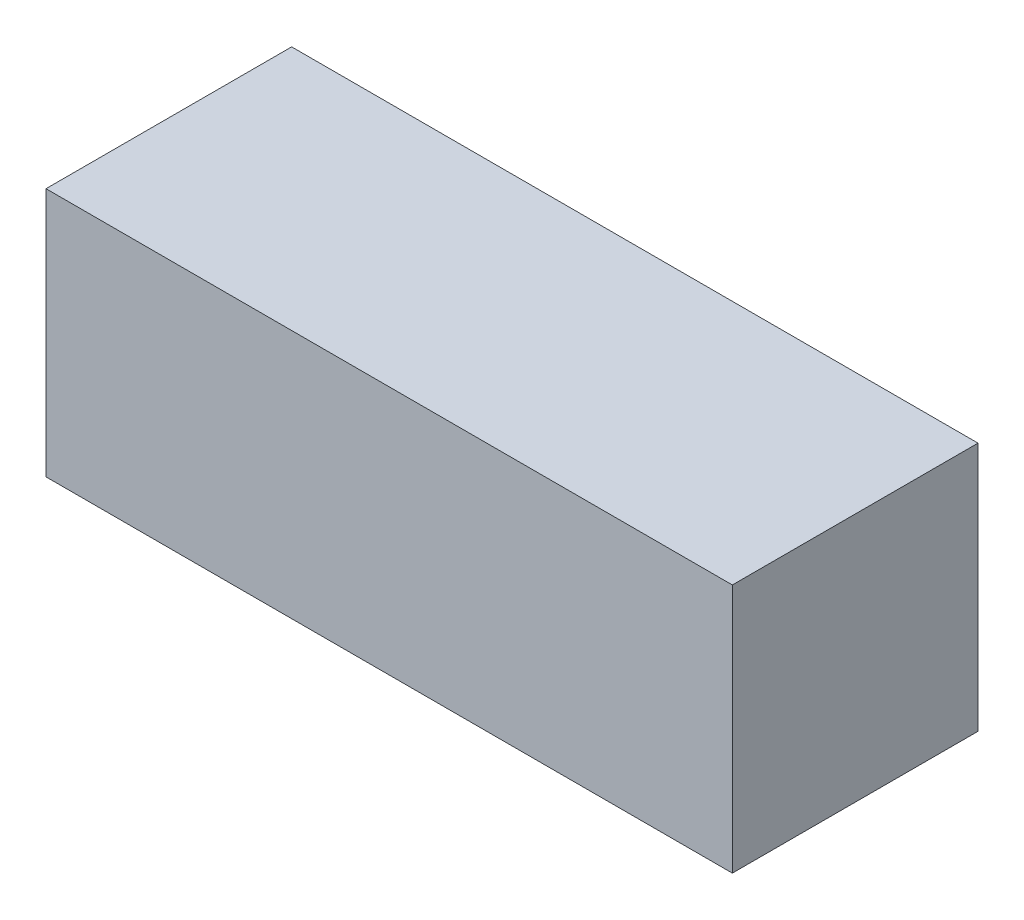
ISO-10303-21;
HEADER;
FILE_DESCRIPTION(('STEP AP214'),'2;1');
FILE_NAME('part.step','',(''),(''),'','','');
FILE_SCHEMA(('AUTOMOTIVE_DESIGN { 1 0 10303 214 1 1 1 1 }'));
ENDSEC;
DATA;
#1=APPLICATION_CONTEXT('core data for automotive mechanical design processes');
#2=APPLICATION_PROTOCOL_DEFINITION('international standard','automotive_design',2000,#1);
#3=PRODUCT_CONTEXT('',#1,'mechanical');
#4=PRODUCT('Part','Part','',(#3));
#5=PRODUCT_RELATED_PRODUCT_CATEGORY('part','',(#4));
#6=PRODUCT_DEFINITION_FORMATION('','',#4);
#7=PRODUCT_DEFINITION_CONTEXT('part definition',#1,'design');
#8=PRODUCT_DEFINITION('design','',#6,#7);
#9=PRODUCT_DEFINITION_SHAPE('','',#8);
#10=(LENGTH_UNIT() NAMED_UNIT(*) SI_UNIT(.MILLI.,.METRE.));
#11=(NAMED_UNIT(*) PLANE_ANGLE_UNIT() SI_UNIT($,.RADIAN.));
#12=(NAMED_UNIT(*) SI_UNIT($,.STERADIAN.) SOLID_ANGLE_UNIT());
#13=UNCERTAINTY_MEASURE_WITH_UNIT(LENGTH_MEASURE(1.E-05),#10,'distance_accuracy_value','');
#14=(GEOMETRIC_REPRESENTATION_CONTEXT(3) GLOBAL_UNCERTAINTY_ASSIGNED_CONTEXT((#13)) GLOBAL_UNIT_ASSIGNED_CONTEXT((#10,
#11,#12)) REPRESENTATION_CONTEXT('',''));
#15=CARTESIAN_POINT('',(0.,0.,0.));
#16=DIRECTION('',(0.,0.,1.));
#17=DIRECTION('',(1.,0.,0.));
#18=AXIS2_PLACEMENT_3D('',#15,#16,#17);
#19=CARTESIAN_POINT('',(0.,0.,0.1999996));
#20=DIRECTION('',(0.,0.,1.));
#21=DIRECTION('',(1.,0.,0.));
#22=AXIS2_PLACEMENT_3D('',#19,#20,#21);
#23=PLANE('',#22);
#24=DIRECTION('',(-1.,0.,0.));
#25=VECTOR('',#24,1.);
#26=CARTESIAN_POINT('',(0.2794,0.1016,0.1999996));
#27=LINE('',#26,#25);
#28=CARTESIAN_POINT('',(0.2794,0.1016,0.1999996));
#29=VERTEX_POINT('',#28);
#30=CARTESIAN_POINT('',(-0.2794,0.1016,0.1999996));
#31=VERTEX_POINT('',#30);
#32=EDGE_CURVE('E89',#29,#31,#27,.T.);
#33=ORIENTED_EDGE('',*,*,#32,.T.);
#34=DIRECTION('',(0.,-1.,0.));
#35=VECTOR('',#34,1.);
#36=CARTESIAN_POINT('',(-0.2794,0.1016,0.1999996));
#37=LINE('',#36,#35);
#38=CARTESIAN_POINT('',(-0.2794,-0.1016,0.1999996));
#39=VERTEX_POINT('',#38);
#40=EDGE_CURVE('E108',#31,#39,#37,.T.);
#41=ORIENTED_EDGE('',*,*,#40,.T.);
#42=DIRECTION('',(1.,0.,0.));
#43=VECTOR('',#42,1.);
#44=CARTESIAN_POINT('',(-0.2794,-0.1016,0.1999996));
#45=LINE('',#44,#43);
#46=CARTESIAN_POINT('',(0.2794,-0.1016,0.1999996));
#47=VERTEX_POINT('',#46);
#48=EDGE_CURVE('E51',#39,#47,#45,.T.);
#49=ORIENTED_EDGE('',*,*,#48,.T.);
#50=DIRECTION('',(0.,1.,0.));
#51=VECTOR('',#50,1.);
#52=CARTESIAN_POINT('',(0.2794,-0.1016,0.1999996));
#53=LINE('',#52,#51);
#54=EDGE_CURVE('E11',#47,#29,#53,.T.);
#55=ORIENTED_EDGE('',*,*,#54,.T.);
#56=EDGE_LOOP('',(#33,#41,#49,#55));
#57=FACE_BOUND('',#56,.T.);
#58=ADVANCED_FACE('F17',(#57),#23,.T.);
#59=CARTESIAN_POINT('',(0.,0.,0.));
#60=DIRECTION('',(0.,0.,1.));
#61=DIRECTION('',(1.,0.,0.));
#62=AXIS2_PLACEMENT_3D('',#59,#60,#61);
#63=PLANE('',#62);
#64=DIRECTION('',(0.,1.,0.));
#65=VECTOR('',#64,1.);
#66=CARTESIAN_POINT('',(0.2794,-0.1016,0.));
#67=LINE('',#66,#65);
#68=CARTESIAN_POINT('',(0.2794,-0.1016,0.));
#69=VERTEX_POINT('',#68);
#70=CARTESIAN_POINT('',(0.2794,0.1016,0.));
#71=VERTEX_POINT('',#70);
#72=EDGE_CURVE('E27',#69,#71,#67,.T.);
#73=ORIENTED_EDGE('',*,*,#72,.F.);
#74=DIRECTION('',(1.,0.,0.));
#75=VECTOR('',#74,1.);
#76=CARTESIAN_POINT('',(-0.2794,-0.1016,0.));
#77=LINE('',#76,#75);
#78=CARTESIAN_POINT('',(-0.2794,-0.1016,0.));
#79=VERTEX_POINT('',#78);
#80=EDGE_CURVE('E60',#79,#69,#77,.T.);
#81=ORIENTED_EDGE('',*,*,#80,.F.);
#82=DIRECTION('',(0.,-1.,0.));
#83=VECTOR('',#82,1.);
#84=CARTESIAN_POINT('',(-0.2794,0.1016,0.));
#85=LINE('',#84,#83);
#86=CARTESIAN_POINT('',(-0.2794,0.1016,0.));
#87=VERTEX_POINT('',#86);
#88=EDGE_CURVE('E91',#87,#79,#85,.T.);
#89=ORIENTED_EDGE('',*,*,#88,.F.);
#90=DIRECTION('',(-1.,0.,0.));
#91=VECTOR('',#90,1.);
#92=CARTESIAN_POINT('',(0.2794,0.1016,0.));
#93=LINE('',#92,#91);
#94=EDGE_CURVE('E88',#71,#87,#93,.T.);
#95=ORIENTED_EDGE('',*,*,#94,.F.);
#96=EDGE_LOOP('',(#73,#81,#89,#95));
#97=FACE_BOUND('',#96,.T.);
#98=ADVANCED_FACE('F93',(#97),#63,.F.);
#99=CARTESIAN_POINT('',(0.2794,-0.1016,0.));
#100=DIRECTION('',(-1.,0.,0.));
#101=DIRECTION('',(0.,0.,1.));
#102=AXIS2_PLACEMENT_3D('',#99,#100,#101);
#103=PLANE('',#102);
#104=ORIENTED_EDGE('',*,*,#72,.T.);
#105=DIRECTION('',(0.,0.,1.));
#106=VECTOR('',#105,1.);
#107=CARTESIAN_POINT('',(0.2794,0.1016,0.));
#108=LINE('',#107,#106);
#109=EDGE_CURVE('E79',#71,#29,#108,.T.);
#110=ORIENTED_EDGE('',*,*,#109,.T.);
#111=ORIENTED_EDGE('',*,*,#54,.F.);
#112=DIRECTION('',(0.,0.,1.));
#113=VECTOR('',#112,1.);
#114=CARTESIAN_POINT('',(0.2794,-0.1016,0.));
#115=LINE('',#114,#113);
#116=EDGE_CURVE('E20',#69,#47,#115,.T.);
#117=ORIENTED_EDGE('',*,*,#116,.F.);
#118=EDGE_LOOP('',(#104,#110,#111,#117));
#119=FACE_BOUND('',#118,.T.);
#120=ADVANCED_FACE('F78',(#119),#103,.F.);
#121=CARTESIAN_POINT('',(-0.2794,-0.1016,0.));
#122=DIRECTION('',(0.,1.,0.));
#123=DIRECTION('',(1.,0.,0.));
#124=AXIS2_PLACEMENT_3D('',#121,#122,#123);
#125=PLANE('',#124);
#126=ORIENTED_EDGE('',*,*,#80,.T.);
#127=ORIENTED_EDGE('',*,*,#116,.T.);
#128=ORIENTED_EDGE('',*,*,#48,.F.);
#129=DIRECTION('',(0.,0.,1.));
#130=VECTOR('',#129,1.);
#131=CARTESIAN_POINT('',(-0.2794,-0.1016,0.));
#132=LINE('',#131,#130);
#133=EDGE_CURVE('E107',#79,#39,#132,.T.);
#134=ORIENTED_EDGE('',*,*,#133,.F.);
#135=EDGE_LOOP('',(#126,#127,#128,#134));
#136=FACE_BOUND('',#135,.T.);
#137=ADVANCED_FACE('F120',(#136),#125,.F.);
#138=CARTESIAN_POINT('',(-0.2794,0.1016,0.));
#139=DIRECTION('',(1.,0.,0.));
#140=DIRECTION('',(0.,1.,0.));
#141=AXIS2_PLACEMENT_3D('',#138,#139,#140);
#142=PLANE('',#141);
#143=ORIENTED_EDGE('',*,*,#88,.T.);
#144=ORIENTED_EDGE('',*,*,#133,.T.);
#145=ORIENTED_EDGE('',*,*,#40,.F.);
#146=DIRECTION('',(0.,0.,1.));
#147=VECTOR('',#146,1.);
#148=CARTESIAN_POINT('',(-0.2794,0.1016,0.));
#149=LINE('',#148,#147);
#150=EDGE_CURVE('E97',#87,#31,#149,.T.);
#151=ORIENTED_EDGE('',*,*,#150,.F.);
#152=EDGE_LOOP('',(#143,#144,#145,#151));
#153=FACE_BOUND('',#152,.T.);
#154=ADVANCED_FACE('F122',(#153),#142,.F.);
#155=CARTESIAN_POINT('',(0.2794,0.1016,0.));
#156=DIRECTION('',(0.,-1.,0.));
#157=DIRECTION('',(0.,0.,-1.));
#158=AXIS2_PLACEMENT_3D('',#155,#156,#157);
#159=PLANE('',#158);
#160=ORIENTED_EDGE('',*,*,#94,.T.);
#161=ORIENTED_EDGE('',*,*,#150,.T.);
#162=ORIENTED_EDGE('',*,*,#32,.F.);
#163=ORIENTED_EDGE('',*,*,#109,.F.);
#164=EDGE_LOOP('',(#160,#161,#162,#163));
#165=FACE_BOUND('',#164,.T.);
#166=ADVANCED_FACE('F86',(#165),#159,.F.);
#167=CLOSED_SHELL('',(#58,#98,#120,#137,#154,#166));
#168=MANIFOLD_SOLID_BREP('B1',#167);
#169=ADVANCED_BREP_SHAPE_REPRESENTATION('',(#18,#168),#14);
#170=SHAPE_DEFINITION_REPRESENTATION(#9,#169);
ENDSEC;
END-ISO-10303-21;
